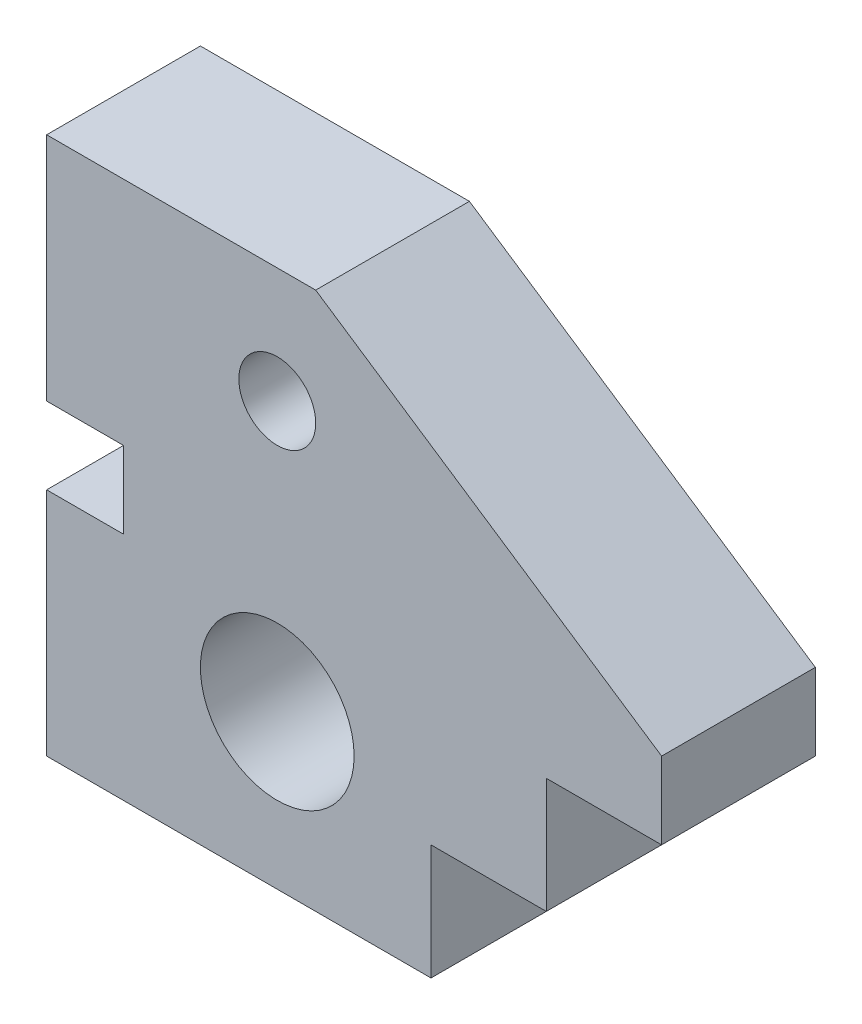
ISO-10303-21;
HEADER;
FILE_DESCRIPTION(('STEP AP214'),'2;1');
FILE_NAME('part.step','',(''),(''),'','','');
FILE_SCHEMA(('AUTOMOTIVE_DESIGN { 1 0 10303 214 1 1 1 1 }'));
ENDSEC;
DATA;
#1=APPLICATION_CONTEXT('core data for automotive mechanical design processes');
#2=APPLICATION_PROTOCOL_DEFINITION('international standard','automotive_design',2000,#1);
#3=PRODUCT_CONTEXT('',#1,'mechanical');
#4=PRODUCT('Part','Part','',(#3));
#5=PRODUCT_RELATED_PRODUCT_CATEGORY('part','',(#4));
#6=PRODUCT_DEFINITION_FORMATION('','',#4);
#7=PRODUCT_DEFINITION_CONTEXT('part definition',#1,'design');
#8=PRODUCT_DEFINITION('design','',#6,#7);
#9=PRODUCT_DEFINITION_SHAPE('','',#8);
#10=(LENGTH_UNIT() NAMED_UNIT(*) SI_UNIT(.MILLI.,.METRE.));
#11=(NAMED_UNIT(*) PLANE_ANGLE_UNIT() SI_UNIT($,.RADIAN.));
#12=(NAMED_UNIT(*) SI_UNIT($,.STERADIAN.) SOLID_ANGLE_UNIT());
#13=UNCERTAINTY_MEASURE_WITH_UNIT(LENGTH_MEASURE(1.E-05),#10,'distance_accuracy_value','');
#14=(GEOMETRIC_REPRESENTATION_CONTEXT(3) GLOBAL_UNCERTAINTY_ASSIGNED_CONTEXT((#13)) GLOBAL_UNIT_ASSIGNED_CONTEXT((#10,
#11,#12)) REPRESENTATION_CONTEXT('',''));
#15=CARTESIAN_POINT('',(0.,0.,0.));
#16=DIRECTION('',(0.,0.,1.));
#17=DIRECTION('',(1.,0.,0.));
#18=AXIS2_PLACEMENT_3D('',#15,#16,#17);
#19=CARTESIAN_POINT('',(0.,8.15664917944959,20.));
#20=DIRECTION('',(0.,-1.,0.));
#21=DIRECTION('',(1.,0.,0.));
#22=AXIS2_PLACEMENT_3D('',#19,#20,#21);
#23=PLANE('',#22);
#24=DIRECTION('',(-1.,0.,0.));
#25=VECTOR('',#24,1.);
#26=CARTESIAN_POINT('',(0.,8.15664917944959,0.));
#27=LINE('',#26,#25);
#28=CARTESIAN_POINT('',(-18.5770153592163,8.15664917944959,0.));
#29=VERTEX_POINT('',#28);
#30=CARTESIAN_POINT('',(-28.5770153592163,8.15664917944959,0.));
#31=VERTEX_POINT('',#30);
#32=EDGE_CURVE('E179',#29,#31,#27,.T.);
#33=ORIENTED_EDGE('',*,*,#32,.T.);
#34=DIRECTION('',(0.,0.,-1.));
#35=VECTOR('',#34,1.);
#36=CARTESIAN_POINT('',(-28.5770153592163,8.15664917944959,20.));
#37=LINE('',#36,#35);
#38=CARTESIAN_POINT('',(-28.5770153592163,8.15664917944959,20.));
#39=VERTEX_POINT('',#38);
#40=EDGE_CURVE('E11',#39,#31,#37,.T.);
#41=ORIENTED_EDGE('',*,*,#40,.F.);
#42=DIRECTION('',(-1.,0.,0.));
#43=VECTOR('',#42,1.);
#44=CARTESIAN_POINT('',(0.,8.15664917944959,20.));
#45=LINE('',#44,#43);
#46=CARTESIAN_POINT('',(-18.5770153592163,8.15664917944959,20.));
#47=VERTEX_POINT('',#46);
#48=EDGE_CURVE('E306',#47,#39,#45,.T.);
#49=ORIENTED_EDGE('',*,*,#48,.F.);
#50=DIRECTION('',(0.,0.,-1.));
#51=VECTOR('',#50,1.);
#52=CARTESIAN_POINT('',(-18.5770153592163,8.15664917944959,20.));
#53=LINE('',#52,#51);
#54=EDGE_CURVE('E167',#47,#29,#53,.T.);
#55=ORIENTED_EDGE('',*,*,#54,.T.);
#56=EDGE_LOOP('',(#33,#41,#49,#55));
#57=FACE_BOUND('',#56,.T.);
#58=ADVANCED_FACE('F39',(#57),#23,.F.);
#59=CARTESIAN_POINT('',(-28.5770153592163,0.,20.));
#60=DIRECTION('',(1.,0.,0.));
#61=DIRECTION('',(0.,0.,-1.));
#62=AXIS2_PLACEMENT_3D('',#59,#60,#61);
#63=PLANE('',#62);
#64=DIRECTION('',(0.,-1.,0.));
#65=VECTOR('',#64,1.);
#66=CARTESIAN_POINT('',(-28.5770153592163,0.,0.));
#67=LINE('',#66,#65);
#68=CARTESIAN_POINT('',(-28.5770153592163,-21.8433508205504,0.));
#69=VERTEX_POINT('',#68);
#70=EDGE_CURVE('E183',#31,#69,#67,.T.);
#71=ORIENTED_EDGE('',*,*,#70,.T.);
#72=DIRECTION('',(0.,0.,-1.));
#73=VECTOR('',#72,1.);
#74=CARTESIAN_POINT('',(-28.5770153592163,-21.8433508205504,20.));
#75=LINE('',#74,#73);
#76=CARTESIAN_POINT('',(-28.5770153592163,-21.8433508205504,20.));
#77=VERTEX_POINT('',#76);
#78=EDGE_CURVE('E49',#77,#69,#75,.T.);
#79=ORIENTED_EDGE('',*,*,#78,.F.);
#80=DIRECTION('',(0.,-1.,0.));
#81=VECTOR('',#80,1.);
#82=CARTESIAN_POINT('',(-28.5770153592163,0.,20.));
#83=LINE('',#82,#81);
#84=EDGE_CURVE('E115',#39,#77,#83,.T.);
#85=ORIENTED_EDGE('',*,*,#84,.F.);
#86=ORIENTED_EDGE('',*,*,#40,.T.);
#87=EDGE_LOOP('',(#71,#79,#85,#86));
#88=FACE_BOUND('',#87,.T.);
#89=ADVANCED_FACE('F321',(#88),#63,.F.);
#90=CARTESIAN_POINT('',(0.,-21.8433508205504,20.));
#91=DIRECTION('',(0.,1.,0.));
#92=DIRECTION('',(0.,0.,1.));
#93=AXIS2_PLACEMENT_3D('',#90,#91,#92);
#94=PLANE('',#93);
#95=DIRECTION('',(1.,0.,0.));
#96=VECTOR('',#95,1.);
#97=CARTESIAN_POINT('',(0.,-21.8433508205504,0.));
#98=LINE('',#97,#96);
#99=CARTESIAN_POINT('',(21.4229846407837,-21.8433508205504,0.));
#100=VERTEX_POINT('',#99);
#101=EDGE_CURVE('E186',#69,#100,#98,.T.);
#102=ORIENTED_EDGE('',*,*,#101,.T.);
#103=DIRECTION('',(0.,0.,-1.));
#104=VECTOR('',#103,1.);
#105=CARTESIAN_POINT('',(21.4229846407837,-21.8433508205504,20.));
#106=LINE('',#105,#104);
#107=CARTESIAN_POINT('',(21.4229846407837,-21.8433508205504,20.));
#108=VERTEX_POINT('',#107);
#109=EDGE_CURVE('E247',#108,#100,#106,.T.);
#110=ORIENTED_EDGE('',*,*,#109,.F.);
#111=DIRECTION('',(1.,0.,0.));
#112=VECTOR('',#111,1.);
#113=CARTESIAN_POINT('',(0.,-21.8433508205504,20.));
#114=LINE('',#113,#112);
#115=EDGE_CURVE('E257',#77,#108,#114,.T.);
#116=ORIENTED_EDGE('',*,*,#115,.F.);
#117=ORIENTED_EDGE('',*,*,#78,.T.);
#118=EDGE_LOOP('',(#102,#110,#116,#117));
#119=FACE_BOUND('',#118,.T.);
#120=ADVANCED_FACE('F255',(#119),#94,.F.);
#121=CARTESIAN_POINT('',(21.4229846407837,0.,20.));
#122=DIRECTION('',(-1.,0.,0.));
#123=DIRECTION('',(0.,0.,1.));
#124=AXIS2_PLACEMENT_3D('',#121,#122,#123);
#125=PLANE('',#124);
#126=DIRECTION('',(0.,1.,0.));
#127=VECTOR('',#126,1.);
#128=CARTESIAN_POINT('',(21.4229846407837,0.,0.));
#129=LINE('',#128,#127);
#130=CARTESIAN_POINT('',(21.4229846407837,-6.84335082055041,0.));
#131=VERTEX_POINT('',#130);
#132=EDGE_CURVE('E189',#100,#131,#129,.T.);
#133=ORIENTED_EDGE('',*,*,#132,.T.);
#134=DIRECTION('',(0.,0.,-1.));
#135=VECTOR('',#134,1.);
#136=CARTESIAN_POINT('',(21.4229846407837,-6.84335082055041,20.));
#137=LINE('',#136,#135);
#138=CARTESIAN_POINT('',(21.4229846407837,-6.84335082055041,20.));
#139=VERTEX_POINT('',#138);
#140=EDGE_CURVE('E243',#139,#131,#137,.T.);
#141=ORIENTED_EDGE('',*,*,#140,.F.);
#142=DIRECTION('',(0.,1.,0.));
#143=VECTOR('',#142,1.);
#144=CARTESIAN_POINT('',(21.4229846407837,0.,20.));
#145=LINE('',#144,#143);
#146=EDGE_CURVE('E276',#108,#139,#145,.T.);
#147=ORIENTED_EDGE('',*,*,#146,.F.);
#148=ORIENTED_EDGE('',*,*,#109,.T.);
#149=EDGE_LOOP('',(#133,#141,#147,#148));
#150=FACE_BOUND('',#149,.T.);
#151=ADVANCED_FACE('F266',(#150),#125,.F.);
#152=CARTESIAN_POINT('',(0.,-6.84335082055041,20.));
#153=DIRECTION('',(0.,1.,0.));
#154=DIRECTION('',(0.,0.,1.));
#155=AXIS2_PLACEMENT_3D('',#152,#153,#154);
#156=PLANE('',#155);
#157=DIRECTION('',(1.,0.,0.));
#158=VECTOR('',#157,1.);
#159=CARTESIAN_POINT('',(0.,-6.84335082055041,0.));
#160=LINE('',#159,#158);
#161=CARTESIAN_POINT('',(36.4229846407837,-6.84335082055041,0.));
#162=VERTEX_POINT('',#161);
#163=EDGE_CURVE('E192',#131,#162,#160,.T.);
#164=ORIENTED_EDGE('',*,*,#163,.T.);
#165=DIRECTION('',(0.,0.,-1.));
#166=VECTOR('',#165,1.);
#167=CARTESIAN_POINT('',(36.4229846407837,-6.84335082055041,20.));
#168=LINE('',#167,#166);
#169=CARTESIAN_POINT('',(36.4229846407837,-6.84335082055041,20.));
#170=VERTEX_POINT('',#169);
#171=EDGE_CURVE('E239',#170,#162,#168,.T.);
#172=ORIENTED_EDGE('',*,*,#171,.F.);
#173=DIRECTION('',(1.,0.,0.));
#174=VECTOR('',#173,1.);
#175=CARTESIAN_POINT('',(0.,-6.84335082055041,20.));
#176=LINE('',#175,#174);
#177=EDGE_CURVE('E272',#139,#170,#176,.T.);
#178=ORIENTED_EDGE('',*,*,#177,.F.);
#179=ORIENTED_EDGE('',*,*,#140,.T.);
#180=EDGE_LOOP('',(#164,#172,#178,#179));
#181=FACE_BOUND('',#180,.T.);
#182=ADVANCED_FACE('F270',(#181),#156,.F.);
#183=CARTESIAN_POINT('',(36.4229846407837,0.,20.));
#184=DIRECTION('',(-1.,0.,0.));
#185=DIRECTION('',(0.,-1.,0.));
#186=AXIS2_PLACEMENT_3D('',#183,#184,#185);
#187=PLANE('',#186);
#188=DIRECTION('',(0.,1.,0.));
#189=VECTOR('',#188,1.);
#190=CARTESIAN_POINT('',(36.4229846407837,0.,0.));
#191=LINE('',#190,#189);
#192=CARTESIAN_POINT('',(36.4229846407837,8.15664917944959,0.));
#193=VERTEX_POINT('',#192);
#194=EDGE_CURVE('E195',#162,#193,#191,.T.);
#195=ORIENTED_EDGE('',*,*,#194,.T.);
#196=DIRECTION('',(0.,0.,-1.));
#197=VECTOR('',#196,1.);
#198=CARTESIAN_POINT('',(36.4229846407837,8.15664917944959,20.));
#199=LINE('',#198,#197);
#200=CARTESIAN_POINT('',(36.4229846407837,8.15664917944959,20.));
#201=VERTEX_POINT('',#200);
#202=EDGE_CURVE('E235',#201,#193,#199,.T.);
#203=ORIENTED_EDGE('',*,*,#202,.F.);
#204=DIRECTION('',(0.,1.,0.));
#205=VECTOR('',#204,1.);
#206=CARTESIAN_POINT('',(36.4229846407837,0.,20.));
#207=LINE('',#206,#205);
#208=EDGE_CURVE('E275',#170,#201,#207,.T.);
#209=ORIENTED_EDGE('',*,*,#208,.F.);
#210=ORIENTED_EDGE('',*,*,#171,.T.);
#211=EDGE_LOOP('',(#195,#203,#209,#210));
#212=FACE_BOUND('',#211,.T.);
#213=ADVANCED_FACE('F413',(#212),#187,.F.);
#214=CARTESIAN_POINT('',(0.,8.15664917944959,20.));
#215=DIRECTION('',(0.,1.,0.));
#216=DIRECTION('',(0.,0.,1.));
#217=AXIS2_PLACEMENT_3D('',#214,#215,#216);
#218=PLANE('',#217);
#219=DIRECTION('',(1.,0.,0.));
#220=VECTOR('',#219,1.);
#221=CARTESIAN_POINT('',(0.,8.15664917944959,0.));
#222=LINE('',#221,#220);
#223=CARTESIAN_POINT('',(51.4229846407837,8.15664917944959,0.));
#224=VERTEX_POINT('',#223);
#225=EDGE_CURVE('E198',#193,#224,#222,.T.);
#226=ORIENTED_EDGE('',*,*,#225,.T.);
#227=DIRECTION('',(0.,0.,-1.));
#228=VECTOR('',#227,1.);
#229=CARTESIAN_POINT('',(51.4229846407837,8.15664917944959,20.));
#230=LINE('',#229,#228);
#231=CARTESIAN_POINT('',(51.4229846407837,8.15664917944959,20.));
#232=VERTEX_POINT('',#231);
#233=EDGE_CURVE('E231',#232,#224,#230,.T.);
#234=ORIENTED_EDGE('',*,*,#233,.F.);
#235=DIRECTION('',(1.,0.,0.));
#236=VECTOR('',#235,1.);
#237=CARTESIAN_POINT('',(0.,8.15664917944959,20.));
#238=LINE('',#237,#236);
#239=EDGE_CURVE('E280',#201,#232,#238,.T.);
#240=ORIENTED_EDGE('',*,*,#239,.F.);
#241=ORIENTED_EDGE('',*,*,#202,.T.);
#242=EDGE_LOOP('',(#226,#234,#240,#241));
#243=FACE_BOUND('',#242,.T.);
#244=ADVANCED_FACE('F403',(#243),#218,.F.);
#245=CARTESIAN_POINT('',(51.4229846407837,0.,20.));
#246=DIRECTION('',(-1.,0.,0.));
#247=DIRECTION('',(0.,0.,1.));
#248=AXIS2_PLACEMENT_3D('',#245,#246,#247);
#249=PLANE('',#248);
#250=DIRECTION('',(0.,1.,0.));
#251=VECTOR('',#250,1.);
#252=CARTESIAN_POINT('',(51.4229846407837,0.,0.));
#253=LINE('',#252,#251);
#254=CARTESIAN_POINT('',(51.4229846407837,18.1566491794496,0.));
#255=VERTEX_POINT('',#254);
#256=EDGE_CURVE('E201',#224,#255,#253,.T.);
#257=ORIENTED_EDGE('',*,*,#256,.T.);
#258=DIRECTION('',(0.,0.,-1.));
#259=VECTOR('',#258,1.);
#260=CARTESIAN_POINT('',(51.4229846407837,18.1566491794496,20.));
#261=LINE('',#260,#259);
#262=CARTESIAN_POINT('',(51.4229846407837,18.1566491794496,20.));
#263=VERTEX_POINT('',#262);
#264=EDGE_CURVE('E227',#263,#255,#261,.T.);
#265=ORIENTED_EDGE('',*,*,#264,.F.);
#266=DIRECTION('',(0.,1.,0.));
#267=VECTOR('',#266,1.);
#268=CARTESIAN_POINT('',(51.4229846407837,0.,20.));
#269=LINE('',#268,#267);
#270=EDGE_CURVE('E287',#232,#263,#269,.T.);
#271=ORIENTED_EDGE('',*,*,#270,.F.);
#272=ORIENTED_EDGE('',*,*,#233,.T.);
#273=EDGE_LOOP('',(#257,#265,#271,#272));
#274=FACE_BOUND('',#273,.T.);
#275=ADVANCED_FACE('F394',(#274),#249,.F.);
#276=CARTESIAN_POINT('',(24.2024487415256,36.3036731122883,20.));
#277=DIRECTION('',(-0.554700196225229,-0.832050294337844,0.));
#278=DIRECTION('',(0.832050294337844,-0.554700196225229,0.));
#279=AXIS2_PLACEMENT_3D('',#276,#277,#278);
#280=PLANE('',#279);
#281=DIRECTION('',(-0.832050294337844,0.554700196225229,0.));
#282=VECTOR('',#281,1.);
#283=CARTESIAN_POINT('',(24.2024487415256,36.3036731122883,0.));
#284=LINE('',#283,#282);
#285=CARTESIAN_POINT('',(6.42298464078367,48.1566491794496,0.));
#286=VERTEX_POINT('',#285);
#287=EDGE_CURVE('E204',#255,#286,#284,.T.);
#288=ORIENTED_EDGE('',*,*,#287,.T.);
#289=DIRECTION('',(0.,0.,-1.));
#290=VECTOR('',#289,1.);
#291=CARTESIAN_POINT('',(6.42298464078367,48.1566491794496,20.));
#292=LINE('',#291,#290);
#293=CARTESIAN_POINT('',(6.42298464078367,48.1566491794496,20.));
#294=VERTEX_POINT('',#293);
#295=EDGE_CURVE('E223',#294,#286,#292,.T.);
#296=ORIENTED_EDGE('',*,*,#295,.F.);
#297=DIRECTION('',(-0.832050294337844,0.554700196225229,0.));
#298=VECTOR('',#297,1.);
#299=CARTESIAN_POINT('',(24.2024487415256,36.3036731122883,20.));
#300=LINE('',#299,#298);
#301=EDGE_CURVE('E290',#263,#294,#300,.T.);
#302=ORIENTED_EDGE('',*,*,#301,.F.);
#303=ORIENTED_EDGE('',*,*,#264,.T.);
#304=EDGE_LOOP('',(#288,#296,#302,#303));
#305=FACE_BOUND('',#304,.T.);
#306=ADVANCED_FACE('F298',(#305),#280,.F.);
#307=CARTESIAN_POINT('',(0.,48.1566491794496,20.));
#308=DIRECTION('',(0.,-1.,0.));
#309=DIRECTION('',(1.,0.,0.));
#310=AXIS2_PLACEMENT_3D('',#307,#308,#309);
#311=PLANE('',#310);
#312=DIRECTION('',(-1.,0.,0.));
#313=VECTOR('',#312,1.);
#314=CARTESIAN_POINT('',(0.,48.1566491794496,0.));
#315=LINE('',#314,#313);
#316=CARTESIAN_POINT('',(-28.5770153592163,48.1566491794496,0.));
#317=VERTEX_POINT('',#316);
#318=EDGE_CURVE('E207',#286,#317,#315,.T.);
#319=ORIENTED_EDGE('',*,*,#318,.T.);
#320=DIRECTION('',(0.,0.,-1.));
#321=VECTOR('',#320,1.);
#322=CARTESIAN_POINT('',(-28.5770153592163,48.1566491794496,20.));
#323=LINE('',#322,#321);
#324=CARTESIAN_POINT('',(-28.5770153592163,48.1566491794496,20.));
#325=VERTEX_POINT('',#324);
#326=EDGE_CURVE('E160',#325,#317,#323,.T.);
#327=ORIENTED_EDGE('',*,*,#326,.F.);
#328=DIRECTION('',(-1.,0.,0.));
#329=VECTOR('',#328,1.);
#330=CARTESIAN_POINT('',(0.,48.1566491794496,20.));
#331=LINE('',#330,#329);
#332=EDGE_CURVE('E149',#294,#325,#331,.T.);
#333=ORIENTED_EDGE('',*,*,#332,.F.);
#334=ORIENTED_EDGE('',*,*,#295,.T.);
#335=EDGE_LOOP('',(#319,#327,#333,#334));
#336=FACE_BOUND('',#335,.T.);
#337=ADVANCED_FACE('F302',(#336),#311,.F.);
#338=CARTESIAN_POINT('',(-28.5770153592163,0.,20.));
#339=DIRECTION('',(1.,0.,0.));
#340=DIRECTION('',(0.,1.,0.));
#341=AXIS2_PLACEMENT_3D('',#338,#339,#340);
#342=PLANE('',#341);
#343=DIRECTION('',(0.,-1.,0.));
#344=VECTOR('',#343,1.);
#345=CARTESIAN_POINT('',(-28.5770153592163,0.,0.));
#346=LINE('',#345,#344);
#347=CARTESIAN_POINT('',(-28.5770153592163,18.1566491794496,0.));
#348=VERTEX_POINT('',#347);
#349=EDGE_CURVE('E158',#317,#348,#346,.T.);
#350=ORIENTED_EDGE('',*,*,#349,.T.);
#351=DIRECTION('',(0.,0.,-1.));
#352=VECTOR('',#351,1.);
#353=CARTESIAN_POINT('',(-28.5770153592163,18.1566491794496,20.));
#354=LINE('',#353,#352);
#355=CARTESIAN_POINT('',(-28.5770153592163,18.1566491794496,20.));
#356=VERTEX_POINT('',#355);
#357=EDGE_CURVE('E155',#356,#348,#354,.T.);
#358=ORIENTED_EDGE('',*,*,#357,.F.);
#359=DIRECTION('',(0.,-1.,0.));
#360=VECTOR('',#359,1.);
#361=CARTESIAN_POINT('',(-28.5770153592163,0.,20.));
#362=LINE('',#361,#360);
#363=EDGE_CURVE('E143',#325,#356,#362,.T.);
#364=ORIENTED_EDGE('',*,*,#363,.F.);
#365=ORIENTED_EDGE('',*,*,#326,.T.);
#366=EDGE_LOOP('',(#350,#358,#364,#365));
#367=FACE_BOUND('',#366,.T.);
#368=ADVANCED_FACE('F156',(#367),#342,.F.);
#369=CARTESIAN_POINT('',(0.,18.1566491794496,20.));
#370=DIRECTION('',(0.,1.,0.));
#371=DIRECTION('',(0.,0.,1.));
#372=AXIS2_PLACEMENT_3D('',#369,#370,#371);
#373=PLANE('',#372);
#374=DIRECTION('',(1.,0.,0.));
#375=VECTOR('',#374,1.);
#376=CARTESIAN_POINT('',(0.,18.1566491794496,0.));
#377=LINE('',#376,#375);
#378=CARTESIAN_POINT('',(-18.5770153592163,18.1566491794496,0.));
#379=VERTEX_POINT('',#378);
#380=EDGE_CURVE('E101',#348,#379,#377,.T.);
#381=ORIENTED_EDGE('',*,*,#380,.T.);
#382=DIRECTION('',(0.,0.,-1.));
#383=VECTOR('',#382,1.);
#384=CARTESIAN_POINT('',(-18.5770153592163,18.1566491794496,20.));
#385=LINE('',#384,#383);
#386=CARTESIAN_POINT('',(-18.5770153592163,18.1566491794496,20.));
#387=VERTEX_POINT('',#386);
#388=EDGE_CURVE('E161',#387,#379,#385,.T.);
#389=ORIENTED_EDGE('',*,*,#388,.F.);
#390=DIRECTION('',(1.,0.,0.));
#391=VECTOR('',#390,1.);
#392=CARTESIAN_POINT('',(0.,18.1566491794496,20.));
#393=LINE('',#392,#391);
#394=EDGE_CURVE('E147',#356,#387,#393,.T.);
#395=ORIENTED_EDGE('',*,*,#394,.F.);
#396=ORIENTED_EDGE('',*,*,#357,.T.);
#397=EDGE_LOOP('',(#381,#389,#395,#396));
#398=FACE_BOUND('',#397,.T.);
#399=ADVANCED_FACE('F163',(#398),#373,.F.);
#400=CARTESIAN_POINT('',(1.42298464078367,-1.84335082055041,20.));
#401=DIRECTION('',(0.,0.,-1.));
#402=DIRECTION('',(-1.,0.,0.));
#403=AXIS2_PLACEMENT_3D('',#400,#401,#402);
#404=CYLINDRICAL_SURFACE('',#403,10.);
#405=CARTESIAN_POINT('',(1.42298464078367,-1.84335082055041,20.));
#406=DIRECTION('',(0.,0.,1.));
#407=DIRECTION('',(1.,0.,0.));
#408=AXIS2_PLACEMENT_3D('',#405,#406,#407);
#409=CIRCLE('',#408,10.);
#410=CARTESIAN_POINT('',(11.4229846407837,-1.84335082055041,20.));
#411=VERTEX_POINT('',#410);
#412=EDGE_CURVE('E336',#411,#411,#409,.T.);
#413=ORIENTED_EDGE('',*,*,#412,.T.);
#414=EDGE_LOOP('',(#413));
#415=FACE_BOUND('',#414,.T.);
#416=CARTESIAN_POINT('',(1.42298464078367,-1.84335082055041,0.));
#417=DIRECTION('',(0.,0.,1.));
#418=DIRECTION('',(1.,0.,0.));
#419=AXIS2_PLACEMENT_3D('',#416,#417,#418);
#420=CIRCLE('',#419,10.);
#421=CARTESIAN_POINT('',(11.4229846407837,-1.84335082055041,0.));
#422=VERTEX_POINT('',#421);
#423=EDGE_CURVE('E175',#422,#422,#420,.T.);
#424=ORIENTED_EDGE('',*,*,#423,.F.);
#425=EDGE_LOOP('',(#424));
#426=FACE_BOUND('',#425,.T.);
#427=ADVANCED_FACE('F316',(#415,#426),#404,.F.);
#428=CARTESIAN_POINT('',(1.42298464078367,33.1566491794496,20.));
#429=DIRECTION('',(0.,0.,-1.));
#430=DIRECTION('',(-1.,0.,0.));
#431=AXIS2_PLACEMENT_3D('',#428,#429,#430);
#432=CYLINDRICAL_SURFACE('',#431,5.);
#433=CARTESIAN_POINT('',(1.42298464078367,33.1566491794496,20.));
#434=DIRECTION('',(0.,0.,1.));
#435=DIRECTION('',(1.,0.,0.));
#436=AXIS2_PLACEMENT_3D('',#433,#434,#435);
#437=CIRCLE('',#436,5.);
#438=CARTESIAN_POINT('',(6.42298464078367,33.1566491794496,20.));
#439=VERTEX_POINT('',#438);
#440=EDGE_CURVE('E216',#439,#439,#437,.T.);
#441=ORIENTED_EDGE('',*,*,#440,.T.);
#442=EDGE_LOOP('',(#441));
#443=FACE_BOUND('',#442,.T.);
#444=CARTESIAN_POINT('',(1.42298464078367,33.1566491794496,0.));
#445=DIRECTION('',(0.,0.,1.));
#446=DIRECTION('',(1.,0.,0.));
#447=AXIS2_PLACEMENT_3D('',#444,#445,#446);
#448=CIRCLE('',#447,5.);
#449=CARTESIAN_POINT('',(6.42298464078367,33.1566491794496,0.));
#450=VERTEX_POINT('',#449);
#451=EDGE_CURVE('E171',#450,#450,#448,.T.);
#452=ORIENTED_EDGE('',*,*,#451,.F.);
#453=EDGE_LOOP('',(#452));
#454=FACE_BOUND('',#453,.T.);
#455=ADVANCED_FACE('F41',(#443,#454),#432,.F.);
#456=CARTESIAN_POINT('',(-18.5770153592163,0.,20.));
#457=DIRECTION('',(1.,0.,0.));
#458=DIRECTION('',(0.,1.,0.));
#459=AXIS2_PLACEMENT_3D('',#456,#457,#458);
#460=PLANE('',#459);
#461=DIRECTION('',(0.,-1.,0.));
#462=VECTOR('',#461,1.);
#463=CARTESIAN_POINT('',(-18.5770153592163,0.,0.));
#464=LINE('',#463,#462);
#465=EDGE_CURVE('E107',#379,#29,#464,.T.);
#466=ORIENTED_EDGE('',*,*,#465,.T.);
#467=ORIENTED_EDGE('',*,*,#54,.F.);
#468=DIRECTION('',(0.,-1.,0.));
#469=VECTOR('',#468,1.);
#470=CARTESIAN_POINT('',(-18.5770153592163,0.,20.));
#471=LINE('',#470,#469);
#472=EDGE_CURVE('E57',#387,#47,#471,.T.);
#473=ORIENTED_EDGE('',*,*,#472,.F.);
#474=ORIENTED_EDGE('',*,*,#388,.T.);
#475=EDGE_LOOP('',(#466,#467,#473,#474));
#476=FACE_BOUND('',#475,.T.);
#477=ADVANCED_FACE('F307',(#476),#460,.F.);
#478=CARTESIAN_POINT('',(0.,0.,20.));
#479=DIRECTION('',(0.,0.,1.));
#480=DIRECTION('',(1.,0.,0.));
#481=AXIS2_PLACEMENT_3D('',#478,#479,#480);
#482=PLANE('',#481);
#483=ORIENTED_EDGE('',*,*,#440,.F.);
#484=EDGE_LOOP('',(#483));
#485=FACE_BOUND('',#484,.T.);
#486=ORIENTED_EDGE('',*,*,#412,.F.);
#487=EDGE_LOOP('',(#486));
#488=FACE_BOUND('',#487,.T.);
#489=ORIENTED_EDGE('',*,*,#48,.T.);
#490=ORIENTED_EDGE('',*,*,#84,.T.);
#491=ORIENTED_EDGE('',*,*,#115,.T.);
#492=ORIENTED_EDGE('',*,*,#146,.T.);
#493=ORIENTED_EDGE('',*,*,#177,.T.);
#494=ORIENTED_EDGE('',*,*,#208,.T.);
#495=ORIENTED_EDGE('',*,*,#239,.T.);
#496=ORIENTED_EDGE('',*,*,#270,.T.);
#497=ORIENTED_EDGE('',*,*,#301,.T.);
#498=ORIENTED_EDGE('',*,*,#332,.T.);
#499=ORIENTED_EDGE('',*,*,#363,.T.);
#500=ORIENTED_EDGE('',*,*,#394,.T.);
#501=ORIENTED_EDGE('',*,*,#472,.T.);
#502=EDGE_LOOP('',(#489,#490,#491,#492,#493,#494,#495,#496,#497,#498,#499,#500,#501));
#503=FACE_BOUND('',#502,.T.);
#504=ADVANCED_FACE('F145',(#485,#488,#503),#482,.T.);
#505=CARTESIAN_POINT('',(0.,0.,0.));
#506=DIRECTION('',(0.,0.,1.));
#507=DIRECTION('',(1.,0.,0.));
#508=AXIS2_PLACEMENT_3D('',#505,#506,#507);
#509=PLANE('',#508);
#510=ORIENTED_EDGE('',*,*,#451,.T.);
#511=EDGE_LOOP('',(#510));
#512=FACE_BOUND('',#511,.T.);
#513=ORIENTED_EDGE('',*,*,#423,.T.);
#514=EDGE_LOOP('',(#513));
#515=FACE_BOUND('',#514,.T.);
#516=ORIENTED_EDGE('',*,*,#32,.F.);
#517=ORIENTED_EDGE('',*,*,#465,.F.);
#518=ORIENTED_EDGE('',*,*,#380,.F.);
#519=ORIENTED_EDGE('',*,*,#349,.F.);
#520=ORIENTED_EDGE('',*,*,#318,.F.);
#521=ORIENTED_EDGE('',*,*,#287,.F.);
#522=ORIENTED_EDGE('',*,*,#256,.F.);
#523=ORIENTED_EDGE('',*,*,#225,.F.);
#524=ORIENTED_EDGE('',*,*,#194,.F.);
#525=ORIENTED_EDGE('',*,*,#163,.F.);
#526=ORIENTED_EDGE('',*,*,#132,.F.);
#527=ORIENTED_EDGE('',*,*,#101,.F.);
#528=ORIENTED_EDGE('',*,*,#70,.F.);
#529=EDGE_LOOP('',(#516,#517,#518,#519,#520,#521,#522,#523,#524,#525,#526,#527,#528));
#530=FACE_BOUND('',#529,.T.);
#531=ADVANCED_FACE('F261',(#512,#515,#530),#509,.F.);
#532=CLOSED_SHELL('',(#58,#89,#120,#151,#182,#213,#244,#275,#306,#337,#368,#399,#427,#455,#477,
#504,#531));
#533=MANIFOLD_SOLID_BREP('B2',#532);
#534=ADVANCED_BREP_SHAPE_REPRESENTATION('',(#18,#533),#14);
#535=SHAPE_DEFINITION_REPRESENTATION(#9,#534);
ENDSEC;
END-ISO-10303-21;
